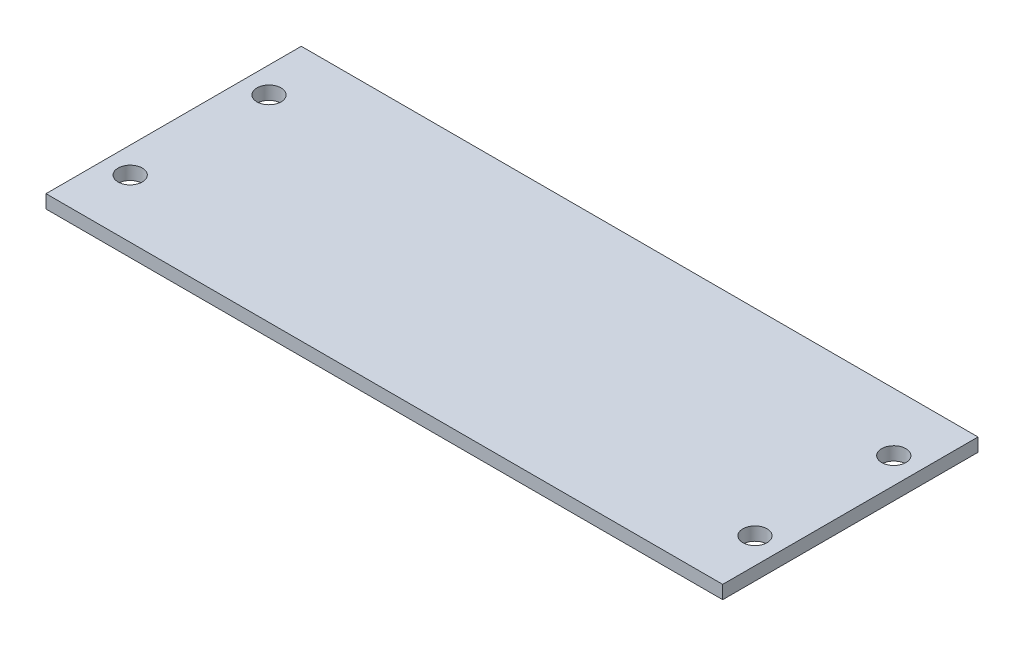
ISO-10303-21;
HEADER;
FILE_DESCRIPTION(('STEP AP214'),'2;1');
FILE_NAME('part.step','',(''),(''),'','','');
FILE_SCHEMA(('AUTOMOTIVE_DESIGN { 1 0 10303 214 1 1 1 1 }'));
ENDSEC;
DATA;
#1=APPLICATION_CONTEXT('core data for automotive mechanical design processes');
#2=APPLICATION_PROTOCOL_DEFINITION('international standard','automotive_design',2000,#1);
#3=PRODUCT_CONTEXT('',#1,'mechanical');
#4=PRODUCT('Part','Part','',(#3));
#5=PRODUCT_RELATED_PRODUCT_CATEGORY('part','',(#4));
#6=PRODUCT_DEFINITION_FORMATION('','',#4);
#7=PRODUCT_DEFINITION_CONTEXT('part definition',#1,'design');
#8=PRODUCT_DEFINITION('design','',#6,#7);
#9=PRODUCT_DEFINITION_SHAPE('','',#8);
#10=(LENGTH_UNIT() NAMED_UNIT(*) SI_UNIT(.MILLI.,.METRE.));
#11=(NAMED_UNIT(*) PLANE_ANGLE_UNIT() SI_UNIT($,.RADIAN.));
#12=(NAMED_UNIT(*) SI_UNIT($,.STERADIAN.) SOLID_ANGLE_UNIT());
#13=UNCERTAINTY_MEASURE_WITH_UNIT(LENGTH_MEASURE(1.E-05),#10,'distance_accuracy_value','');
#14=(GEOMETRIC_REPRESENTATION_CONTEXT(3) GLOBAL_UNCERTAINTY_ASSIGNED_CONTEXT((#13)) GLOBAL_UNIT_ASSIGNED_CONTEXT((#10,
#11,#12)) REPRESENTATION_CONTEXT('',''));
#15=CARTESIAN_POINT('',(0.,0.,0.));
#16=DIRECTION('',(0.,0.,1.));
#17=DIRECTION('',(1.,0.,0.));
#18=AXIS2_PLACEMENT_3D('',#15,#16,#17);
#19=CARTESIAN_POINT('',(0.,1.1,0.));
#20=DIRECTION('',(0.,-1.,0.));
#21=DIRECTION('',(0.,0.,-1.));
#22=AXIS2_PLACEMENT_3D('',#19,#20,#21);
#23=PLANE('',#22);
#24=DIRECTION('',(0.,0.,1.));
#25=VECTOR('',#24,1.);
#26=CARTESIAN_POINT('',(0.,1.1,0.));
#27=LINE('',#26,#25);
#28=CARTESIAN_POINT('',(0.,1.1,-21.082));
#29=VERTEX_POINT('',#28);
#30=CARTESIAN_POINT('',(0.,1.1,0.));
#31=VERTEX_POINT('',#30);
#32=EDGE_CURVE('E99',#29,#31,#27,.T.);
#33=ORIENTED_EDGE('',*,*,#32,.T.);
#34=DIRECTION('',(1.,0.,0.));
#35=VECTOR('',#34,1.);
#36=CARTESIAN_POINT('',(0.,1.1,0.));
#37=LINE('',#36,#35);
#38=CARTESIAN_POINT('',(55.88,1.1,0.));
#39=VERTEX_POINT('',#38);
#40=EDGE_CURVE('E94',#31,#39,#37,.T.);
#41=ORIENTED_EDGE('',*,*,#40,.T.);
#42=DIRECTION('',(0.,0.,-1.));
#43=VECTOR('',#42,1.);
#44=CARTESIAN_POINT('',(55.88,1.1,0.));
#45=LINE('',#44,#43);
#46=CARTESIAN_POINT('',(55.88,1.1,-21.082));
#47=VERTEX_POINT('',#46);
#48=EDGE_CURVE('E97',#39,#47,#45,.T.);
#49=ORIENTED_EDGE('',*,*,#48,.T.);
#50=DIRECTION('',(-1.,0.,0.));
#51=VECTOR('',#50,1.);
#52=CARTESIAN_POINT('',(0.,1.1,-21.082));
#53=LINE('',#52,#51);
#54=EDGE_CURVE('E64',#47,#29,#53,.T.);
#55=ORIENTED_EDGE('',*,*,#54,.T.);
#56=EDGE_LOOP('',(#33,#41,#49,#55));
#57=FACE_BOUND('',#56,.T.);
#58=CARTESIAN_POINT('',(2.143,1.1,-16.272));
#59=DIRECTION('',(0.,1.,0.));
#60=DIRECTION('',(0.,0.,1.));
#61=AXIS2_PLACEMENT_3D('',#58,#59,#60);
#62=CIRCLE('',#61,1.);
#63=CARTESIAN_POINT('',(2.143,1.1,-15.272));
#64=VERTEX_POINT('',#63);
#65=EDGE_CURVE('E114',#64,#64,#62,.T.);
#66=ORIENTED_EDGE('',*,*,#65,.F.);
#67=EDGE_LOOP('',(#66));
#68=FACE_BOUND('',#67,.T.);
#69=CARTESIAN_POINT('',(2.143,1.1,-4.81));
#70=DIRECTION('',(0.,1.,0.));
#71=DIRECTION('',(0.,0.,1.));
#72=AXIS2_PLACEMENT_3D('',#69,#70,#71);
#73=CIRCLE('',#72,1.);
#74=CARTESIAN_POINT('',(2.143,1.1,-3.81));
#75=VERTEX_POINT('',#74);
#76=EDGE_CURVE('E129',#75,#75,#73,.T.);
#77=ORIENTED_EDGE('',*,*,#76,.F.);
#78=EDGE_LOOP('',(#77));
#79=FACE_BOUND('',#78,.T.);
#80=CARTESIAN_POINT('',(53.737,1.1,-16.272));
#81=DIRECTION('',(0.,1.,0.));
#82=DIRECTION('',(0.,0.,1.));
#83=AXIS2_PLACEMENT_3D('',#80,#81,#82);
#84=CIRCLE('',#83,0.999999999999998);
#85=CARTESIAN_POINT('',(53.737,1.1,-15.272));
#86=VERTEX_POINT('',#85);
#87=EDGE_CURVE('E135',#86,#86,#84,.T.);
#88=ORIENTED_EDGE('',*,*,#87,.F.);
#89=EDGE_LOOP('',(#88));
#90=FACE_BOUND('',#89,.T.);
#91=CARTESIAN_POINT('',(53.737,1.1,-4.81));
#92=DIRECTION('',(0.,1.,0.));
#93=DIRECTION('',(0.,0.,1.));
#94=AXIS2_PLACEMENT_3D('',#91,#92,#93);
#95=CIRCLE('',#94,0.999999999999998);
#96=CARTESIAN_POINT('',(53.737,1.1,-3.81));
#97=VERTEX_POINT('',#96);
#98=EDGE_CURVE('E141',#97,#97,#95,.T.);
#99=ORIENTED_EDGE('',*,*,#98,.F.);
#100=EDGE_LOOP('',(#99));
#101=FACE_BOUND('',#100,.T.);
#102=ADVANCED_FACE('F47',(#57,#68,#79,#90,#101),#23,.F.);
#103=CARTESIAN_POINT('',(0.,0.,0.));
#104=DIRECTION('',(0.,-1.,0.));
#105=DIRECTION('',(0.,0.,-1.));
#106=AXIS2_PLACEMENT_3D('',#103,#104,#105);
#107=PLANE('',#106);
#108=CARTESIAN_POINT('',(53.737,0.,-16.272));
#109=DIRECTION('',(0.,1.,0.));
#110=DIRECTION('',(0.,0.,1.));
#111=AXIS2_PLACEMENT_3D('',#108,#109,#110);
#112=CIRCLE('',#111,0.999999999999998);
#113=CARTESIAN_POINT('',(53.737,0.,-15.272));
#114=VERTEX_POINT('',#113);
#115=EDGE_CURVE('E138',#114,#114,#112,.T.);
#116=ORIENTED_EDGE('',*,*,#115,.T.);
#117=EDGE_LOOP('',(#116));
#118=FACE_BOUND('',#117,.T.);
#119=CARTESIAN_POINT('',(2.143,0.,-16.272));
#120=DIRECTION('',(0.,1.,0.));
#121=DIRECTION('',(0.,0.,1.));
#122=AXIS2_PLACEMENT_3D('',#119,#120,#121);
#123=CIRCLE('',#122,1.);
#124=CARTESIAN_POINT('',(2.143,0.,-15.272));
#125=VERTEX_POINT('',#124);
#126=EDGE_CURVE('E126',#125,#125,#123,.T.);
#127=ORIENTED_EDGE('',*,*,#126,.T.);
#128=EDGE_LOOP('',(#127));
#129=FACE_BOUND('',#128,.T.);
#130=DIRECTION('',(0.,0.,1.));
#131=VECTOR('',#130,1.);
#132=CARTESIAN_POINT('',(0.,0.,0.));
#133=LINE('',#132,#131);
#134=CARTESIAN_POINT('',(0.,0.,-21.082));
#135=VERTEX_POINT('',#134);
#136=CARTESIAN_POINT('',(0.,0.,0.));
#137=VERTEX_POINT('',#136);
#138=EDGE_CURVE('E111',#135,#137,#133,.T.);
#139=ORIENTED_EDGE('',*,*,#138,.F.);
#140=DIRECTION('',(-1.,0.,0.));
#141=VECTOR('',#140,1.);
#142=CARTESIAN_POINT('',(0.,0.,-21.082));
#143=LINE('',#142,#141);
#144=CARTESIAN_POINT('',(55.88,0.,-21.082));
#145=VERTEX_POINT('',#144);
#146=EDGE_CURVE('E87',#145,#135,#143,.T.);
#147=ORIENTED_EDGE('',*,*,#146,.F.);
#148=DIRECTION('',(0.,0.,-1.));
#149=VECTOR('',#148,1.);
#150=CARTESIAN_POINT('',(55.88,0.,0.));
#151=LINE('',#150,#149);
#152=CARTESIAN_POINT('',(55.88,0.,0.));
#153=VERTEX_POINT('',#152);
#154=EDGE_CURVE('E81',#153,#145,#151,.T.);
#155=ORIENTED_EDGE('',*,*,#154,.F.);
#156=DIRECTION('',(1.,0.,0.));
#157=VECTOR('',#156,1.);
#158=CARTESIAN_POINT('',(0.,0.,0.));
#159=LINE('',#158,#157);
#160=EDGE_CURVE('E103',#137,#153,#159,.T.);
#161=ORIENTED_EDGE('',*,*,#160,.F.);
#162=EDGE_LOOP('',(#139,#147,#155,#161));
#163=FACE_BOUND('',#162,.T.);
#164=CARTESIAN_POINT('',(2.143,0.,-4.81));
#165=DIRECTION('',(0.,1.,0.));
#166=DIRECTION('',(0.,0.,1.));
#167=AXIS2_PLACEMENT_3D('',#164,#165,#166);
#168=CIRCLE('',#167,1.);
#169=CARTESIAN_POINT('',(2.143,0.,-3.81));
#170=VERTEX_POINT('',#169);
#171=EDGE_CURVE('E132',#170,#170,#168,.T.);
#172=ORIENTED_EDGE('',*,*,#171,.T.);
#173=EDGE_LOOP('',(#172));
#174=FACE_BOUND('',#173,.T.);
#175=CARTESIAN_POINT('',(53.737,0.,-4.81));
#176=DIRECTION('',(0.,1.,0.));
#177=DIRECTION('',(0.,0.,1.));
#178=AXIS2_PLACEMENT_3D('',#175,#176,#177);
#179=CIRCLE('',#178,0.999999999999998);
#180=CARTESIAN_POINT('',(53.737,0.,-3.81));
#181=VERTEX_POINT('',#180);
#182=EDGE_CURVE('E144',#181,#181,#179,.T.);
#183=ORIENTED_EDGE('',*,*,#182,.T.);
#184=EDGE_LOOP('',(#183));
#185=FACE_BOUND('',#184,.T.);
#186=ADVANCED_FACE('F122',(#118,#129,#163,#174,#185),#107,.T.);
#187=CARTESIAN_POINT('',(0.,1.1,0.));
#188=DIRECTION('',(1.,0.,0.));
#189=DIRECTION('',(0.,0.,-1.));
#190=AXIS2_PLACEMENT_3D('',#187,#188,#189);
#191=PLANE('',#190);
#192=ORIENTED_EDGE('',*,*,#138,.T.);
#193=DIRECTION('',(0.,-1.,0.));
#194=VECTOR('',#193,1.);
#195=CARTESIAN_POINT('',(0.,1.1,0.));
#196=LINE('',#195,#194);
#197=EDGE_CURVE('E11',#31,#137,#196,.T.);
#198=ORIENTED_EDGE('',*,*,#197,.F.);
#199=ORIENTED_EDGE('',*,*,#32,.F.);
#200=DIRECTION('',(0.,-1.,0.));
#201=VECTOR('',#200,1.);
#202=CARTESIAN_POINT('',(0.,1.1,-21.082));
#203=LINE('',#202,#201);
#204=EDGE_CURVE('E107',#29,#135,#203,.T.);
#205=ORIENTED_EDGE('',*,*,#204,.T.);
#206=EDGE_LOOP('',(#192,#198,#199,#205));
#207=FACE_BOUND('',#206,.T.);
#208=ADVANCED_FACE('F49',(#207),#191,.F.);
#209=CARTESIAN_POINT('',(0.,1.1,0.));
#210=DIRECTION('',(0.,0.,-1.));
#211=DIRECTION('',(-1.,0.,0.));
#212=AXIS2_PLACEMENT_3D('',#209,#210,#211);
#213=PLANE('',#212);
#214=ORIENTED_EDGE('',*,*,#160,.T.);
#215=DIRECTION('',(0.,-1.,0.));
#216=VECTOR('',#215,1.);
#217=CARTESIAN_POINT('',(55.88,1.1,0.));
#218=LINE('',#217,#216);
#219=EDGE_CURVE('E56',#39,#153,#218,.T.);
#220=ORIENTED_EDGE('',*,*,#219,.F.);
#221=ORIENTED_EDGE('',*,*,#40,.F.);
#222=ORIENTED_EDGE('',*,*,#197,.T.);
#223=EDGE_LOOP('',(#214,#220,#221,#222));
#224=FACE_BOUND('',#223,.T.);
#225=ADVANCED_FACE('F102',(#224),#213,.F.);
#226=CARTESIAN_POINT('',(55.88,1.1,0.));
#227=DIRECTION('',(-1.,0.,0.));
#228=DIRECTION('',(0.,0.,1.));
#229=AXIS2_PLACEMENT_3D('',#226,#227,#228);
#230=PLANE('',#229);
#231=ORIENTED_EDGE('',*,*,#154,.T.);
#232=DIRECTION('',(0.,-1.,0.));
#233=VECTOR('',#232,1.);
#234=CARTESIAN_POINT('',(55.88,1.1,-21.082));
#235=LINE('',#234,#233);
#236=EDGE_CURVE('E104',#47,#145,#235,.T.);
#237=ORIENTED_EDGE('',*,*,#236,.F.);
#238=ORIENTED_EDGE('',*,*,#48,.F.);
#239=ORIENTED_EDGE('',*,*,#219,.T.);
#240=EDGE_LOOP('',(#231,#237,#238,#239));
#241=FACE_BOUND('',#240,.T.);
#242=ADVANCED_FACE('F105',(#241),#230,.F.);
#243=CARTESIAN_POINT('',(0.,1.1,-21.082));
#244=DIRECTION('',(0.,0.,1.));
#245=DIRECTION('',(1.,0.,0.));
#246=AXIS2_PLACEMENT_3D('',#243,#244,#245);
#247=PLANE('',#246);
#248=ORIENTED_EDGE('',*,*,#146,.T.);
#249=ORIENTED_EDGE('',*,*,#204,.F.);
#250=ORIENTED_EDGE('',*,*,#54,.F.);
#251=ORIENTED_EDGE('',*,*,#236,.T.);
#252=EDGE_LOOP('',(#248,#249,#250,#251));
#253=FACE_BOUND('',#252,.T.);
#254=ADVANCED_FACE('F119',(#253),#247,.F.);
#255=CARTESIAN_POINT('',(2.143,1.1,-16.272));
#256=DIRECTION('',(0.,-1.,0.));
#257=DIRECTION('',(0.,0.,-1.));
#258=AXIS2_PLACEMENT_3D('',#255,#256,#257);
#259=CYLINDRICAL_SURFACE('',#258,1.);
#260=ORIENTED_EDGE('',*,*,#65,.T.);
#261=EDGE_LOOP('',(#260));
#262=FACE_BOUND('',#261,.T.);
#263=ORIENTED_EDGE('',*,*,#126,.F.);
#264=EDGE_LOOP('',(#263));
#265=FACE_BOUND('',#264,.T.);
#266=ADVANCED_FACE('F161',(#262,#265),#259,.F.);
#267=CARTESIAN_POINT('',(2.143,1.1,-4.81));
#268=DIRECTION('',(0.,-1.,0.));
#269=DIRECTION('',(0.,0.,-1.));
#270=AXIS2_PLACEMENT_3D('',#267,#268,#269);
#271=CYLINDRICAL_SURFACE('',#270,1.);
#272=ORIENTED_EDGE('',*,*,#76,.T.);
#273=EDGE_LOOP('',(#272));
#274=FACE_BOUND('',#273,.T.);
#275=ORIENTED_EDGE('',*,*,#171,.F.);
#276=EDGE_LOOP('',(#275));
#277=FACE_BOUND('',#276,.T.);
#278=ADVANCED_FACE('F229',(#274,#277),#271,.F.);
#279=CARTESIAN_POINT('',(53.737,1.1,-16.272));
#280=DIRECTION('',(0.,-1.,0.));
#281=DIRECTION('',(0.,0.,-1.));
#282=AXIS2_PLACEMENT_3D('',#279,#280,#281);
#283=CYLINDRICAL_SURFACE('',#282,0.999999999999998);
#284=ORIENTED_EDGE('',*,*,#87,.T.);
#285=EDGE_LOOP('',(#284));
#286=FACE_BOUND('',#285,.T.);
#287=ORIENTED_EDGE('',*,*,#115,.F.);
#288=EDGE_LOOP('',(#287));
#289=FACE_BOUND('',#288,.T.);
#290=ADVANCED_FACE('F240',(#286,#289),#283,.F.);
#291=CARTESIAN_POINT('',(53.737,1.1,-4.81));
#292=DIRECTION('',(0.,-1.,0.));
#293=DIRECTION('',(0.,0.,-1.));
#294=AXIS2_PLACEMENT_3D('',#291,#292,#293);
#295=CYLINDRICAL_SURFACE('',#294,0.999999999999998);
#296=ORIENTED_EDGE('',*,*,#98,.T.);
#297=EDGE_LOOP('',(#296));
#298=FACE_BOUND('',#297,.T.);
#299=ORIENTED_EDGE('',*,*,#182,.F.);
#300=EDGE_LOOP('',(#299));
#301=FACE_BOUND('',#300,.T.);
#302=ADVANCED_FACE('F150',(#298,#301),#295,.F.);
#303=CLOSED_SHELL('',(#102,#186,#208,#225,#242,#254,#266,#278,#290,#302));
#304=MANIFOLD_SOLID_BREP('B2',#303);
#305=ADVANCED_BREP_SHAPE_REPRESENTATION('',(#18,#304),#14);
#306=SHAPE_DEFINITION_REPRESENTATION(#9,#305);
ENDSEC;
END-ISO-10303-21;
